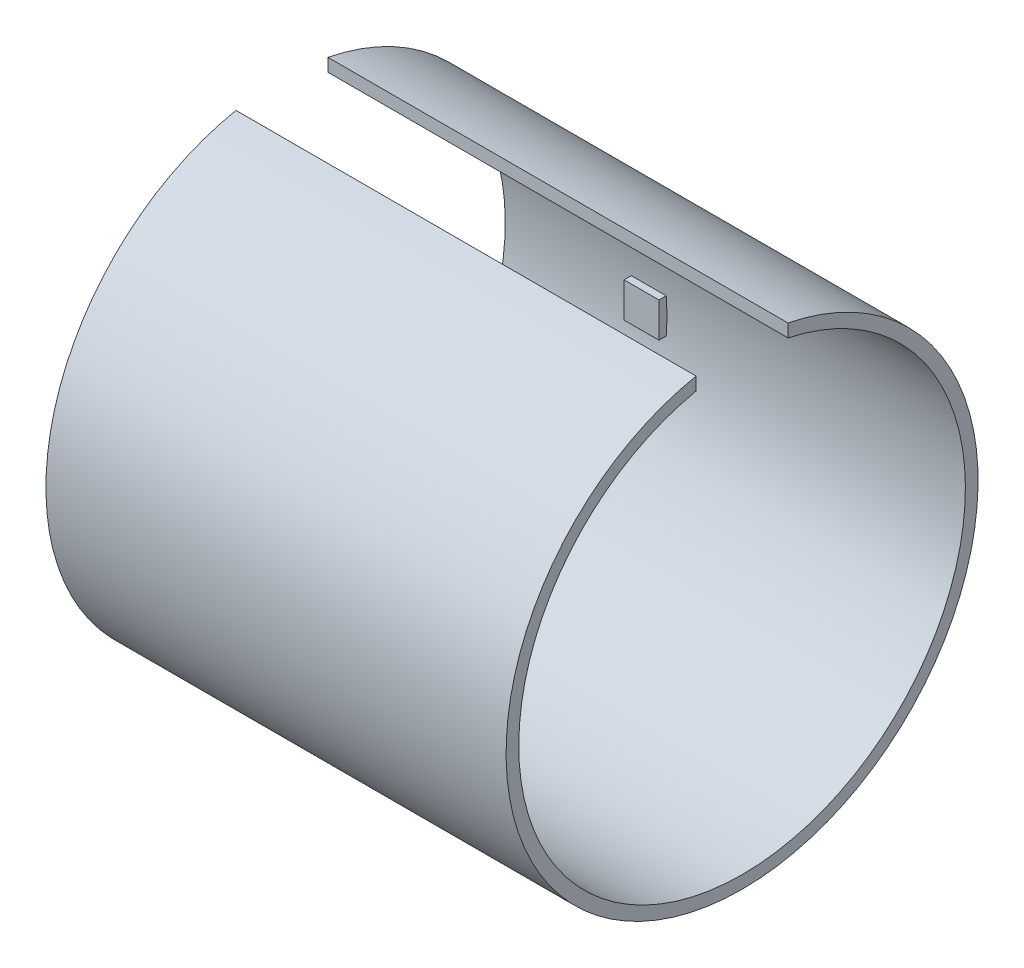
ISO-10303-21;
HEADER;
FILE_DESCRIPTION(('STEP AP214'),'2;1');
FILE_NAME('part.step','',(''),(''),'','','');
FILE_SCHEMA(('AUTOMOTIVE_DESIGN { 1 0 10303 214 1 1 1 1 }'));
ENDSEC;
DATA;
#1=APPLICATION_CONTEXT('core data for automotive mechanical design processes');
#2=APPLICATION_PROTOCOL_DEFINITION('international standard','automotive_design',2000,#1);
#3=PRODUCT_CONTEXT('',#1,'mechanical');
#4=PRODUCT('Part','Part','',(#3));
#5=PRODUCT_RELATED_PRODUCT_CATEGORY('part','',(#4));
#6=PRODUCT_DEFINITION_FORMATION('','',#4);
#7=PRODUCT_DEFINITION_CONTEXT('part definition',#1,'design');
#8=PRODUCT_DEFINITION('design','',#6,#7);
#9=PRODUCT_DEFINITION_SHAPE('','',#8);
#10=(LENGTH_UNIT() NAMED_UNIT(*) SI_UNIT(.MILLI.,.METRE.));
#11=(NAMED_UNIT(*) PLANE_ANGLE_UNIT() SI_UNIT($,.RADIAN.));
#12=(NAMED_UNIT(*) SI_UNIT($,.STERADIAN.) SOLID_ANGLE_UNIT());
#13=UNCERTAINTY_MEASURE_WITH_UNIT(LENGTH_MEASURE(1.E-05),#10,'distance_accuracy_value','');
#14=(GEOMETRIC_REPRESENTATION_CONTEXT(3) GLOBAL_UNCERTAINTY_ASSIGNED_CONTEXT((#13)) GLOBAL_UNIT_ASSIGNED_CONTEXT((#10,
#11,#12)) REPRESENTATION_CONTEXT('',''));
#15=CARTESIAN_POINT('',(0.,0.,0.));
#16=DIRECTION('',(0.,0.,1.));
#17=DIRECTION('',(1.,0.,0.));
#18=AXIS2_PLACEMENT_3D('',#15,#16,#17);
#19=CARTESIAN_POINT('',(12.954,-1.397,-17.265000014));
#20=DIRECTION('',(-1.,0.,0.));
#21=DIRECTION('',(0.,0.,1.));
#22=AXIS2_PLACEMENT_3D('',#19,#20,#21);
#23=PLANE('',#22);
#24=DIRECTION('',(0.,0.,1.));
#25=VECTOR('',#24,1.);
#26=CARTESIAN_POINT('',(12.954,1.397,-17.265000014));
#27=LINE('',#26,#25);
#28=CARTESIAN_POINT('',(12.954,1.397,-17.265000014));
#29=VERTEX_POINT('',#28);
#30=CARTESIAN_POINT('',(12.954,1.397,-17.8454025171751));
#31=VERTEX_POINT('',#30);
#32=EDGE_CURVE('E101',#29,#31,#27,.F.);
#33=ORIENTED_EDGE('',*,*,#32,.F.);
#34=DIRECTION('',(0.,1.,0.));
#35=VECTOR('',#34,1.);
#36=CARTESIAN_POINT('',(12.954,-1.397,-17.265000014));
#37=LINE('',#36,#35);
#38=CARTESIAN_POINT('',(12.954,-1.397,-17.265000014));
#39=VERTEX_POINT('',#38);
#40=EDGE_CURVE('E125',#39,#29,#37,.T.);
#41=ORIENTED_EDGE('',*,*,#40,.F.);
#42=DIRECTION('',(0.,0.,1.));
#43=VECTOR('',#42,1.);
#44=CARTESIAN_POINT('',(12.954,-1.397,-17.265000014));
#45=LINE('',#44,#43);
#46=CARTESIAN_POINT('',(12.954,-1.397,-17.8454025171751));
#47=VERTEX_POINT('',#46);
#48=EDGE_CURVE('E119',#47,#39,#45,.T.);
#49=ORIENTED_EDGE('',*,*,#48,.F.);
#50=CARTESIAN_POINT('',(12.954,0.,0.));
#51=DIRECTION('',(-1.,0.,0.));
#52=DIRECTION('',(0.,0.,1.));
#53=AXIS2_PLACEMENT_3D('',#50,#51,#52);
#54=CIRCLE('',#53,17.9);
#55=EDGE_CURVE('E20',#31,#47,#54,.T.);
#56=ORIENTED_EDGE('',*,*,#55,.F.);
#57=EDGE_LOOP('',(#33,#41,#49,#56));
#58=FACE_BOUND('',#57,.T.);
#59=ADVANCED_FACE('F17',(#58),#23,.F.);
#60=CARTESIAN_POINT('',(10.16,1.397,-17.265000014));
#61=DIRECTION('',(1.,0.,0.));
#62=DIRECTION('',(0.,0.,-1.));
#63=AXIS2_PLACEMENT_3D('',#60,#61,#62);
#64=PLANE('',#63);
#65=DIRECTION('',(0.,0.,-1.));
#66=VECTOR('',#65,1.);
#67=CARTESIAN_POINT('',(10.16,-1.397,-17.265000014));
#68=LINE('',#67,#66);
#69=CARTESIAN_POINT('',(10.16,-1.397,-17.265000014));
#70=VERTEX_POINT('',#69);
#71=CARTESIAN_POINT('',(10.16,-1.397,-17.8454025171751));
#72=VERTEX_POINT('',#71);
#73=EDGE_CURVE('E121',#70,#72,#68,.T.);
#74=ORIENTED_EDGE('',*,*,#73,.F.);
#75=DIRECTION('',(0.,1.,0.));
#76=VECTOR('',#75,1.);
#77=CARTESIAN_POINT('',(10.16,-1.397,-17.265000014));
#78=LINE('',#77,#76);
#79=CARTESIAN_POINT('',(10.16,1.397,-17.265000014));
#80=VERTEX_POINT('',#79);
#81=EDGE_CURVE('E134',#80,#70,#78,.F.);
#82=ORIENTED_EDGE('',*,*,#81,.F.);
#83=DIRECTION('',(0.,0.,-1.));
#84=VECTOR('',#83,1.);
#85=CARTESIAN_POINT('',(10.16,1.397,-17.265000014));
#86=LINE('',#85,#84);
#87=CARTESIAN_POINT('',(10.16,1.397,-17.8454025171751));
#88=VERTEX_POINT('',#87);
#89=EDGE_CURVE('E115',#88,#80,#86,.F.);
#90=ORIENTED_EDGE('',*,*,#89,.F.);
#91=CARTESIAN_POINT('',(10.16,0.,0.));
#92=DIRECTION('',(-1.,0.,0.));
#93=DIRECTION('',(0.,0.,1.));
#94=AXIS2_PLACEMENT_3D('',#91,#92,#93);
#95=CIRCLE('',#94,17.9);
#96=EDGE_CURVE('E152',#72,#88,#95,.F.);
#97=ORIENTED_EDGE('',*,*,#96,.F.);
#98=EDGE_LOOP('',(#74,#82,#90,#97));
#99=FACE_BOUND('',#98,.T.);
#100=ADVANCED_FACE('F306',(#99),#64,.F.);
#101=CARTESIAN_POINT('',(10.16,-1.397,-17.265000014));
#102=DIRECTION('',(0.,0.,1.));
#103=DIRECTION('',(1.,0.,0.));
#104=AXIS2_PLACEMENT_3D('',#101,#102,#103);
#105=PLANE('',#104);
#106=ORIENTED_EDGE('',*,*,#81,.T.);
#107=DIRECTION('',(-1.,0.,0.));
#108=VECTOR('',#107,1.);
#109=CARTESIAN_POINT('',(10.16,-1.397,-17.265000014));
#110=LINE('',#109,#108);
#111=EDGE_CURVE('E140',#70,#39,#110,.F.);
#112=ORIENTED_EDGE('',*,*,#111,.T.);
#113=ORIENTED_EDGE('',*,*,#40,.T.);
#114=DIRECTION('',(1.,0.,0.));
#115=VECTOR('',#114,1.);
#116=CARTESIAN_POINT('',(12.954,1.397,-17.265000014));
#117=LINE('',#116,#115);
#118=EDGE_CURVE('E137',#29,#80,#117,.F.);
#119=ORIENTED_EDGE('',*,*,#118,.T.);
#120=EDGE_LOOP('',(#106,#112,#113,#119));
#121=FACE_BOUND('',#120,.T.);
#122=ADVANCED_FACE('F304',(#121),#105,.T.);
#123=CARTESIAN_POINT('',(12.954,1.397,-17.265000014));
#124=DIRECTION('',(0.,-1.,0.));
#125=DIRECTION('',(1.,0.,0.));
#126=AXIS2_PLACEMENT_3D('',#123,#124,#125);
#127=PLANE('',#126);
#128=ORIENTED_EDGE('',*,*,#89,.T.);
#129=ORIENTED_EDGE('',*,*,#118,.F.);
#130=ORIENTED_EDGE('',*,*,#32,.T.);
#131=DIRECTION('',(-1.,0.,0.));
#132=VECTOR('',#131,1.);
#133=CARTESIAN_POINT('',(36.8808,1.397,-17.8454025171751));
#134=LINE('',#133,#132);
#135=EDGE_CURVE('E112',#31,#88,#134,.T.);
#136=ORIENTED_EDGE('',*,*,#135,.T.);
#137=EDGE_LOOP('',(#128,#129,#130,#136));
#138=FACE_BOUND('',#137,.T.);
#139=ADVANCED_FACE('F299',(#138),#127,.F.);
#140=CARTESIAN_POINT('',(10.16,-1.397,-17.265000014));
#141=DIRECTION('',(0.,1.,0.));
#142=DIRECTION('',(-1.,0.,0.));
#143=AXIS2_PLACEMENT_3D('',#140,#141,#142);
#144=PLANE('',#143);
#145=ORIENTED_EDGE('',*,*,#48,.T.);
#146=ORIENTED_EDGE('',*,*,#111,.F.);
#147=ORIENTED_EDGE('',*,*,#73,.T.);
#148=DIRECTION('',(-1.,0.,0.));
#149=VECTOR('',#148,1.);
#150=CARTESIAN_POINT('',(36.8808,-1.39699999999999,-17.8454025171751));
#151=LINE('',#150,#149);
#152=EDGE_CURVE('E110',#72,#47,#151,.F.);
#153=ORIENTED_EDGE('',*,*,#152,.T.);
#154=EDGE_LOOP('',(#145,#146,#147,#153));
#155=FACE_BOUND('',#154,.T.);
#156=ADVANCED_FACE('F117',(#155),#144,.F.);
#157=CARTESIAN_POINT('',(10.16,-1.397,-18.281000014));
#158=DIRECTION('',(1.,0.,0.));
#159=DIRECTION('',(0.,0.,-1.));
#160=AXIS2_PLACEMENT_3D('',#157,#158,#159);
#161=PLANE('',#160);
#162=CARTESIAN_POINT('',(10.16,0.,0.));
#163=DIRECTION('',(-1.,0.,0.));
#164=DIRECTION('',(0.,0.,1.));
#165=AXIS2_PLACEMENT_3D('',#162,#163,#164);
#166=CIRCLE('',#165,18.916);
#167=CARTESIAN_POINT('',(10.16,-1.397,-18.8643432697775));
#168=VERTEX_POINT('',#167);
#169=CARTESIAN_POINT('',(10.16,1.397,-18.8643432697775));
#170=VERTEX_POINT('',#169);
#171=EDGE_CURVE('E171',#168,#170,#166,.F.);
#172=ORIENTED_EDGE('',*,*,#171,.T.);
#173=DIRECTION('',(0.,0.,1.));
#174=VECTOR('',#173,1.);
#175=CARTESIAN_POINT('',(10.16,1.397,-18.281000014));
#176=LINE('',#175,#174);
#177=CARTESIAN_POINT('',(10.16,1.397,-18.281000014));
#178=VERTEX_POINT('',#177);
#179=EDGE_CURVE('E193',#178,#170,#176,.F.);
#180=ORIENTED_EDGE('',*,*,#179,.F.);
#181=DIRECTION('',(0.,1.,0.));
#182=VECTOR('',#181,1.);
#183=CARTESIAN_POINT('',(10.16,1.397,-18.281000014));
#184=LINE('',#183,#182);
#185=CARTESIAN_POINT('',(10.16,-1.397,-18.281000014));
#186=VERTEX_POINT('',#185);
#187=EDGE_CURVE('E186',#186,#178,#184,.T.);
#188=ORIENTED_EDGE('',*,*,#187,.F.);
#189=DIRECTION('',(0.,0.,-1.));
#190=VECTOR('',#189,1.);
#191=CARTESIAN_POINT('',(10.16,-1.397,-18.281000014));
#192=LINE('',#191,#190);
#193=EDGE_CURVE('E142',#186,#168,#192,.T.);
#194=ORIENTED_EDGE('',*,*,#193,.T.);
#195=EDGE_LOOP('',(#172,#180,#188,#194));
#196=FACE_BOUND('',#195,.T.);
#197=ADVANCED_FACE('F261',(#196),#161,.T.);
#198=CARTESIAN_POINT('',(12.954,-1.397,-18.281000014));
#199=DIRECTION('',(-1.,0.,0.));
#200=DIRECTION('',(0.,0.,1.));
#201=AXIS2_PLACEMENT_3D('',#198,#199,#200);
#202=PLANE('',#201);
#203=DIRECTION('',(0.,0.,1.));
#204=VECTOR('',#203,1.);
#205=CARTESIAN_POINT('',(12.954,1.397,-18.281000014));
#206=LINE('',#205,#204);
#207=CARTESIAN_POINT('',(12.954,1.397,-18.8643432697775));
#208=VERTEX_POINT('',#207);
#209=CARTESIAN_POINT('',(12.954,1.397,-18.281000014));
#210=VERTEX_POINT('',#209);
#211=EDGE_CURVE('E196',#208,#210,#206,.T.);
#212=ORIENTED_EDGE('',*,*,#211,.F.);
#213=CARTESIAN_POINT('',(12.954,0.,0.));
#214=DIRECTION('',(-1.,0.,0.));
#215=DIRECTION('',(0.,0.,1.));
#216=AXIS2_PLACEMENT_3D('',#213,#214,#215);
#217=CIRCLE('',#216,18.916);
#218=CARTESIAN_POINT('',(12.954,-1.397,-18.8643432697775));
#219=VERTEX_POINT('',#218);
#220=EDGE_CURVE('E169',#208,#219,#217,.T.);
#221=ORIENTED_EDGE('',*,*,#220,.T.);
#222=DIRECTION('',(0.,0.,1.));
#223=VECTOR('',#222,1.);
#224=CARTESIAN_POINT('',(12.954,-1.397,-18.281000014));
#225=LINE('',#224,#223);
#226=CARTESIAN_POINT('',(12.954,-1.397,-18.281000014));
#227=VERTEX_POINT('',#226);
#228=EDGE_CURVE('E35',#219,#227,#225,.T.);
#229=ORIENTED_EDGE('',*,*,#228,.T.);
#230=DIRECTION('',(0.,1.,0.));
#231=VECTOR('',#230,1.);
#232=CARTESIAN_POINT('',(12.954,1.397,-18.281000014));
#233=LINE('',#232,#231);
#234=EDGE_CURVE('E168',#210,#227,#233,.F.);
#235=ORIENTED_EDGE('',*,*,#234,.F.);
#236=EDGE_LOOP('',(#212,#221,#229,#235));
#237=FACE_BOUND('',#236,.T.);
#238=ADVANCED_FACE('F252',(#237),#202,.T.);
#239=CARTESIAN_POINT('',(36.8808,17.5170063367003,3.683));
#240=DIRECTION('',(0.,0.,1.));
#241=DIRECTION('',(1.,0.,0.));
#242=AXIS2_PLACEMENT_3D('',#239,#240,#241);
#243=PLANE('',#242);
#244=DIRECTION('',(0.,1.,0.));
#245=VECTOR('',#244,1.);
#246=CARTESIAN_POINT('',(36.8808,0.,3.683));
#247=LINE('',#246,#245);
#248=CARTESIAN_POINT('',(36.8808,17.5170063367003,3.683));
#249=VERTEX_POINT('',#248);
#250=CARTESIAN_POINT('',(36.8808,18.5539905950176,3.683));
#251=VERTEX_POINT('',#250);
#252=EDGE_CURVE('E167',#249,#251,#247,.T.);
#253=ORIENTED_EDGE('',*,*,#252,.F.);
#254=DIRECTION('',(-1.,0.,0.));
#255=VECTOR('',#254,1.);
#256=CARTESIAN_POINT('',(36.8808,17.5170063367003,3.683));
#257=LINE('',#256,#255);
#258=CARTESIAN_POINT('',(0.,17.5170063367003,3.683));
#259=VERTEX_POINT('',#258);
#260=EDGE_CURVE('E122',#249,#259,#257,.T.);
#261=ORIENTED_EDGE('',*,*,#260,.T.);
#262=DIRECTION('',(0.,1.,0.));
#263=VECTOR('',#262,1.);
#264=CARTESIAN_POINT('',(0.,17.5170063367003,3.683));
#265=LINE('',#264,#263);
#266=CARTESIAN_POINT('',(0.,18.5539905950176,3.683));
#267=VERTEX_POINT('',#266);
#268=EDGE_CURVE('E146',#267,#259,#265,.F.);
#269=ORIENTED_EDGE('',*,*,#268,.F.);
#270=DIRECTION('',(-1.,0.,0.));
#271=VECTOR('',#270,1.);
#272=CARTESIAN_POINT('',(36.8808,18.5539905950176,3.683));
#273=LINE('',#272,#271);
#274=EDGE_CURVE('E218',#251,#267,#273,.T.);
#275=ORIENTED_EDGE('',*,*,#274,.F.);
#276=EDGE_LOOP('',(#253,#261,#269,#275));
#277=FACE_BOUND('',#276,.T.);
#278=ADVANCED_FACE('F250',(#277),#243,.F.);
#279=CARTESIAN_POINT('',(36.8808,0.,0.));
#280=DIRECTION('',(-1.,0.,0.));
#281=DIRECTION('',(0.,0.,1.));
#282=AXIS2_PLACEMENT_3D('',#279,#280,#281);
#283=CYLINDRICAL_SURFACE('',#282,17.9);
#284=ORIENTED_EDGE('',*,*,#96,.T.);
#285=ORIENTED_EDGE('',*,*,#135,.F.);
#286=ORIENTED_EDGE('',*,*,#55,.T.);
#287=ORIENTED_EDGE('',*,*,#152,.F.);
#288=EDGE_LOOP('',(#284,#285,#286,#287));
#289=FACE_BOUND('',#288,.T.);
#290=CARTESIAN_POINT('',(36.8808,0.,0.));
#291=DIRECTION('',(-1.,0.,0.));
#292=DIRECTION('',(0.,0.,1.));
#293=AXIS2_PLACEMENT_3D('',#290,#291,#292);
#294=CIRCLE('',#293,17.9);
#295=CARTESIAN_POINT('',(36.8808,17.5170063367003,-3.683));
#296=VERTEX_POINT('',#295);
#297=EDGE_CURVE('E164',#296,#249,#294,.T.);
#298=ORIENTED_EDGE('',*,*,#297,.F.);
#299=DIRECTION('',(-1.,0.,0.));
#300=VECTOR('',#299,1.);
#301=CARTESIAN_POINT('',(36.8808,17.5170063367003,-3.683));
#302=LINE('',#301,#300);
#303=CARTESIAN_POINT('',(0.,17.5170063367003,-3.683));
#304=VERTEX_POINT('',#303);
#305=EDGE_CURVE('E190',#296,#304,#302,.T.);
#306=ORIENTED_EDGE('',*,*,#305,.T.);
#307=CARTESIAN_POINT('',(0.,0.,0.));
#308=DIRECTION('',(-1.,0.,0.));
#309=DIRECTION('',(0.,0.,1.));
#310=AXIS2_PLACEMENT_3D('',#307,#308,#309);
#311=CIRCLE('',#310,17.9);
#312=EDGE_CURVE('E159',#304,#259,#311,.T.);
#313=ORIENTED_EDGE('',*,*,#312,.T.);
#314=ORIENTED_EDGE('',*,*,#260,.F.);
#315=EDGE_LOOP('',(#298,#306,#313,#314));
#316=FACE_BOUND('',#315,.T.);
#317=ADVANCED_FACE('F108',(#289,#316),#283,.F.);
#318=CARTESIAN_POINT('',(10.16,1.397,-18.281000014));
#319=DIRECTION('',(0.,-1.,0.));
#320=DIRECTION('',(1.,0.,0.));
#321=AXIS2_PLACEMENT_3D('',#318,#319,#320);
#322=PLANE('',#321);
#323=DIRECTION('',(-1.,0.,0.));
#324=VECTOR('',#323,1.);
#325=CARTESIAN_POINT('',(36.8808,1.397,-18.8643432697775));
#326=LINE('',#325,#324);
#327=EDGE_CURVE('E162',#208,#170,#326,.T.);
#328=ORIENTED_EDGE('',*,*,#327,.F.);
#329=ORIENTED_EDGE('',*,*,#211,.T.);
#330=DIRECTION('',(-1.,0.,0.));
#331=VECTOR('',#330,1.);
#332=CARTESIAN_POINT('',(12.954,1.397,-18.281000014));
#333=LINE('',#332,#331);
#334=EDGE_CURVE('E189',#178,#210,#333,.F.);
#335=ORIENTED_EDGE('',*,*,#334,.F.);
#336=ORIENTED_EDGE('',*,*,#179,.T.);
#337=EDGE_LOOP('',(#328,#329,#335,#336));
#338=FACE_BOUND('',#337,.T.);
#339=ADVANCED_FACE('F259',(#338),#322,.T.);
#340=CARTESIAN_POINT('',(36.8808,17.5170063367003,-3.683));
#341=DIRECTION('',(0.,0.,-1.));
#342=DIRECTION('',(-1.,0.,0.));
#343=AXIS2_PLACEMENT_3D('',#340,#341,#342);
#344=PLANE('',#343);
#345=DIRECTION('',(0.,1.,0.));
#346=VECTOR('',#345,1.);
#347=CARTESIAN_POINT('',(36.8808,0.,-3.683));
#348=LINE('',#347,#346);
#349=CARTESIAN_POINT('',(36.8808,18.5539905950176,-3.683));
#350=VERTEX_POINT('',#349);
#351=EDGE_CURVE('E221',#350,#296,#348,.F.);
#352=ORIENTED_EDGE('',*,*,#351,.F.);
#353=DIRECTION('',(-1.,0.,0.));
#354=VECTOR('',#353,1.);
#355=CARTESIAN_POINT('',(36.8808,18.5539905950176,-3.683));
#356=LINE('',#355,#354);
#357=CARTESIAN_POINT('',(0.,18.5539905950176,-3.683));
#358=VERTEX_POINT('',#357);
#359=EDGE_CURVE('E182',#358,#350,#356,.F.);
#360=ORIENTED_EDGE('',*,*,#359,.F.);
#361=DIRECTION('',(0.,1.,0.));
#362=VECTOR('',#361,1.);
#363=CARTESIAN_POINT('',(0.,0.,-3.683));
#364=LINE('',#363,#362);
#365=EDGE_CURVE('E163',#358,#304,#364,.F.);
#366=ORIENTED_EDGE('',*,*,#365,.T.);
#367=ORIENTED_EDGE('',*,*,#305,.F.);
#368=EDGE_LOOP('',(#352,#360,#366,#367));
#369=FACE_BOUND('',#368,.T.);
#370=ADVANCED_FACE('F238',(#369),#344,.F.);
#371=CARTESIAN_POINT('',(12.954,1.397,-18.281000014));
#372=DIRECTION('',(0.,0.,-1.));
#373=DIRECTION('',(-1.,0.,0.));
#374=AXIS2_PLACEMENT_3D('',#371,#372,#373);
#375=PLANE('',#374);
#376=ORIENTED_EDGE('',*,*,#234,.T.);
#377=DIRECTION('',(-1.,0.,0.));
#378=VECTOR('',#377,1.);
#379=CARTESIAN_POINT('',(10.16,-1.397,-18.281000014));
#380=LINE('',#379,#378);
#381=EDGE_CURVE('E158',#186,#227,#380,.F.);
#382=ORIENTED_EDGE('',*,*,#381,.F.);
#383=ORIENTED_EDGE('',*,*,#187,.T.);
#384=ORIENTED_EDGE('',*,*,#334,.T.);
#385=EDGE_LOOP('',(#376,#382,#383,#384));
#386=FACE_BOUND('',#385,.T.);
#387=ADVANCED_FACE('F276',(#386),#375,.T.);
#388=CARTESIAN_POINT('',(36.8808,0.,0.));
#389=DIRECTION('',(1.,0.,0.));
#390=DIRECTION('',(0.,0.,-1.));
#391=AXIS2_PLACEMENT_3D('',#388,#389,#390);
#392=PLANE('',#391);
#393=CARTESIAN_POINT('',(36.8808,0.,0.));
#394=DIRECTION('',(-1.,0.,0.));
#395=DIRECTION('',(0.,0.,1.));
#396=AXIS2_PLACEMENT_3D('',#393,#394,#395);
#397=CIRCLE('',#396,18.916);
#398=EDGE_CURVE('E156',#350,#251,#397,.T.);
#399=ORIENTED_EDGE('',*,*,#398,.F.);
#400=ORIENTED_EDGE('',*,*,#351,.T.);
#401=ORIENTED_EDGE('',*,*,#297,.T.);
#402=ORIENTED_EDGE('',*,*,#252,.T.);
#403=EDGE_LOOP('',(#399,#400,#401,#402));
#404=FACE_BOUND('',#403,.T.);
#405=ADVANCED_FACE('F244',(#404),#392,.T.);
#406=CARTESIAN_POINT('',(0.,0.,0.));
#407=DIRECTION('',(1.,0.,0.));
#408=DIRECTION('',(0.,0.,-1.));
#409=AXIS2_PLACEMENT_3D('',#406,#407,#408);
#410=PLANE('',#409);
#411=ORIENTED_EDGE('',*,*,#312,.F.);
#412=ORIENTED_EDGE('',*,*,#365,.F.);
#413=CARTESIAN_POINT('',(0.,0.,0.));
#414=DIRECTION('',(-1.,0.,0.));
#415=DIRECTION('',(0.,0.,1.));
#416=AXIS2_PLACEMENT_3D('',#413,#414,#415);
#417=CIRCLE('',#416,18.916);
#418=EDGE_CURVE('E26',#267,#358,#417,.F.);
#419=ORIENTED_EDGE('',*,*,#418,.F.);
#420=ORIENTED_EDGE('',*,*,#268,.T.);
#421=EDGE_LOOP('',(#411,#412,#419,#420));
#422=FACE_BOUND('',#421,.T.);
#423=ADVANCED_FACE('F240',(#422),#410,.F.);
#424=CARTESIAN_POINT('',(10.16,-1.397,-18.281000014));
#425=DIRECTION('',(0.,1.,0.));
#426=DIRECTION('',(-1.,0.,0.));
#427=AXIS2_PLACEMENT_3D('',#424,#425,#426);
#428=PLANE('',#427);
#429=DIRECTION('',(-1.,0.,0.));
#430=VECTOR('',#429,1.);
#431=CARTESIAN_POINT('',(36.8808,-1.39699999999999,-18.8643432697775));
#432=LINE('',#431,#430);
#433=EDGE_CURVE('E11',#168,#219,#432,.F.);
#434=ORIENTED_EDGE('',*,*,#433,.F.);
#435=ORIENTED_EDGE('',*,*,#193,.F.);
#436=ORIENTED_EDGE('',*,*,#381,.T.);
#437=ORIENTED_EDGE('',*,*,#228,.F.);
#438=EDGE_LOOP('',(#434,#435,#436,#437));
#439=FACE_BOUND('',#438,.T.);
#440=ADVANCED_FACE('F264',(#439),#428,.T.);
#441=CARTESIAN_POINT('',(36.8808,0.,0.));
#442=DIRECTION('',(-1.,0.,0.));
#443=DIRECTION('',(0.,0.,1.));
#444=AXIS2_PLACEMENT_3D('',#441,#442,#443);
#445=CYLINDRICAL_SURFACE('',#444,18.916);
#446=ORIENTED_EDGE('',*,*,#359,.T.);
#447=ORIENTED_EDGE('',*,*,#398,.T.);
#448=ORIENTED_EDGE('',*,*,#274,.T.);
#449=ORIENTED_EDGE('',*,*,#418,.T.);
#450=EDGE_LOOP('',(#446,#447,#448,#449));
#451=FACE_BOUND('',#450,.T.);
#452=ORIENTED_EDGE('',*,*,#433,.T.);
#453=ORIENTED_EDGE('',*,*,#220,.F.);
#454=ORIENTED_EDGE('',*,*,#327,.T.);
#455=ORIENTED_EDGE('',*,*,#171,.F.);
#456=EDGE_LOOP('',(#452,#453,#454,#455));
#457=FACE_BOUND('',#456,.T.);
#458=ADVANCED_FACE('F247',(#451,#457),#445,.T.);
#459=CLOSED_SHELL('',(#59,#100,#122,#139,#156,#197,#238,#278,#317,#339,#370,#387,#405,#423,#440,#458));
#460=MANIFOLD_SOLID_BREP('B1',#459);
#461=ADVANCED_BREP_SHAPE_REPRESENTATION('',(#18,#460),#14);
#462=SHAPE_DEFINITION_REPRESENTATION(#9,#461);
ENDSEC;
END-ISO-10303-21;
